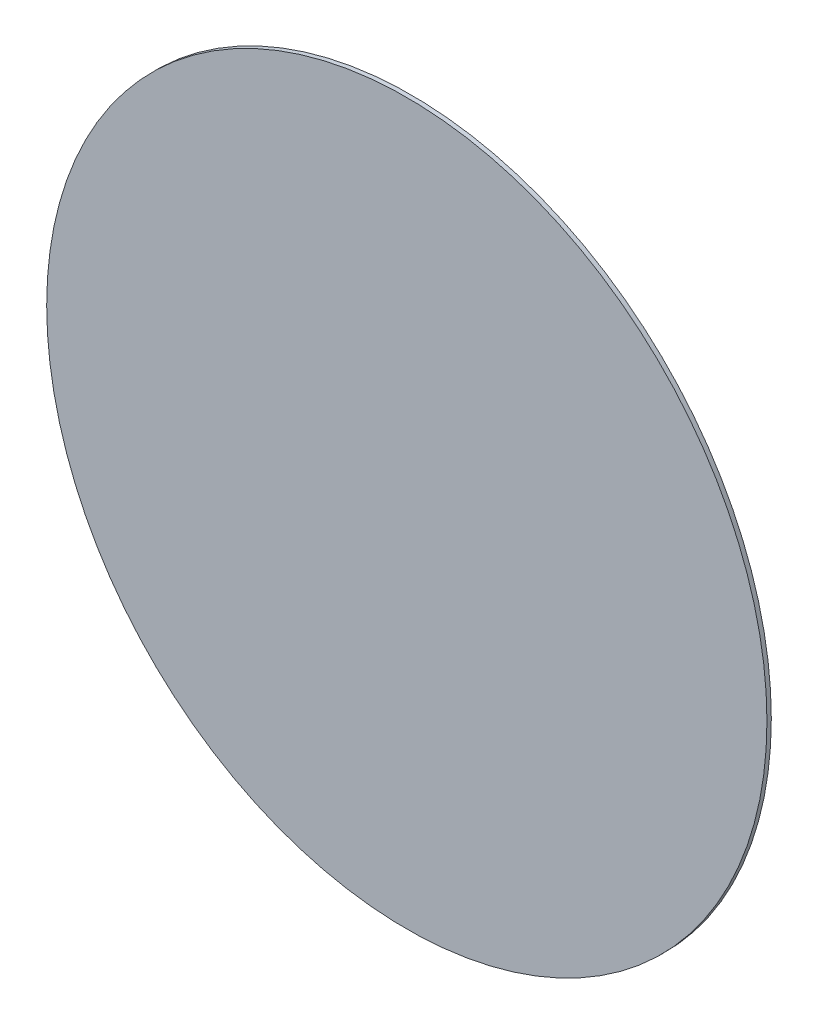
ISO-10303-21;
HEADER;
FILE_DESCRIPTION(('STEP AP214'),'2;1');
FILE_NAME('part.step','',(''),(''),'','','');
FILE_SCHEMA(('AUTOMOTIVE_DESIGN { 1 0 10303 214 1 1 1 1 }'));
ENDSEC;
DATA;
#1=APPLICATION_CONTEXT('core data for automotive mechanical design processes');
#2=APPLICATION_PROTOCOL_DEFINITION('international standard','automotive_design',2000,#1);
#3=PRODUCT_CONTEXT('',#1,'mechanical');
#4=PRODUCT('Part','Part','',(#3));
#5=PRODUCT_RELATED_PRODUCT_CATEGORY('part','',(#4));
#6=PRODUCT_DEFINITION_FORMATION('','',#4);
#7=PRODUCT_DEFINITION_CONTEXT('part definition',#1,'design');
#8=PRODUCT_DEFINITION('design','',#6,#7);
#9=PRODUCT_DEFINITION_SHAPE('','',#8);
#10=(LENGTH_UNIT() NAMED_UNIT(*) SI_UNIT(.MILLI.,.METRE.));
#11=(NAMED_UNIT(*) PLANE_ANGLE_UNIT() SI_UNIT($,.RADIAN.));
#12=(NAMED_UNIT(*) SI_UNIT($,.STERADIAN.) SOLID_ANGLE_UNIT());
#13=UNCERTAINTY_MEASURE_WITH_UNIT(LENGTH_MEASURE(1.E-05),#10,'distance_accuracy_value','');
#14=(GEOMETRIC_REPRESENTATION_CONTEXT(3) GLOBAL_UNCERTAINTY_ASSIGNED_CONTEXT((#13)) GLOBAL_UNIT_ASSIGNED_CONTEXT((#10,
#11,#12)) REPRESENTATION_CONTEXT('',''));
#15=CARTESIAN_POINT('',(0.,0.,0.));
#16=DIRECTION('',(0.,0.,1.));
#17=DIRECTION('',(1.,0.,0.));
#18=AXIS2_PLACEMENT_3D('',#15,#16,#17);
#19=CARTESIAN_POINT('',(0.,0.,0.2));
#20=DIRECTION('',(0.,0.,-1.));
#21=DIRECTION('',(-1.,0.,0.));
#22=AXIS2_PLACEMENT_3D('',#19,#20,#21);
#23=CYLINDRICAL_SURFACE('',#22,16.5);
#24=CARTESIAN_POINT('',(0.,0.,0.2));
#25=DIRECTION('',(0.,0.,1.));
#26=DIRECTION('',(1.,0.,0.));
#27=AXIS2_PLACEMENT_3D('',#24,#25,#26);
#28=CIRCLE('',#27,16.5);
#29=CARTESIAN_POINT('',(16.5,0.,0.2));
#30=VERTEX_POINT('',#29);
#31=EDGE_CURVE('E10',#30,#30,#28,.T.);
#32=ORIENTED_EDGE('',*,*,#31,.F.);
#33=EDGE_LOOP('',(#32));
#34=FACE_BOUND('',#33,.T.);
#35=CARTESIAN_POINT('',(0.,0.,0.));
#36=DIRECTION('',(0.,0.,1.));
#37=DIRECTION('',(1.,0.,0.));
#38=AXIS2_PLACEMENT_3D('',#35,#36,#37);
#39=CIRCLE('',#38,16.5);
#40=CARTESIAN_POINT('',(16.5,0.,0.));
#41=VERTEX_POINT('',#40);
#42=EDGE_CURVE('E34',#41,#41,#39,.T.);
#43=ORIENTED_EDGE('',*,*,#42,.T.);
#44=EDGE_LOOP('',(#43));
#45=FACE_BOUND('',#44,.T.);
#46=ADVANCED_FACE('F31',(#34,#45),#23,.T.);
#47=CARTESIAN_POINT('',(0.,0.,0.2));
#48=DIRECTION('',(0.,0.,1.));
#49=DIRECTION('',(1.,0.,0.));
#50=AXIS2_PLACEMENT_3D('',#47,#48,#49);
#51=PLANE('',#50);
#52=ORIENTED_EDGE('',*,*,#31,.T.);
#53=EDGE_LOOP('',(#52));
#54=FACE_BOUND('',#53,.T.);
#55=ADVANCED_FACE('F46',(#54),#51,.T.);
#56=CARTESIAN_POINT('',(0.,0.,0.));
#57=DIRECTION('',(0.,0.,1.));
#58=DIRECTION('',(1.,0.,0.));
#59=AXIS2_PLACEMENT_3D('',#56,#57,#58);
#60=PLANE('',#59);
#61=ORIENTED_EDGE('',*,*,#42,.F.);
#62=EDGE_LOOP('',(#61));
#63=FACE_BOUND('',#62,.T.);
#64=ADVANCED_FACE('F44',(#63),#60,.F.);
#65=CLOSED_SHELL('',(#46,#55,#64));
#66=MANIFOLD_SOLID_BREP('B2',#65);
#67=ADVANCED_BREP_SHAPE_REPRESENTATION('',(#18,#66),#14);
#68=SHAPE_DEFINITION_REPRESENTATION(#9,#67);
ENDSEC;
END-ISO-10303-21;
